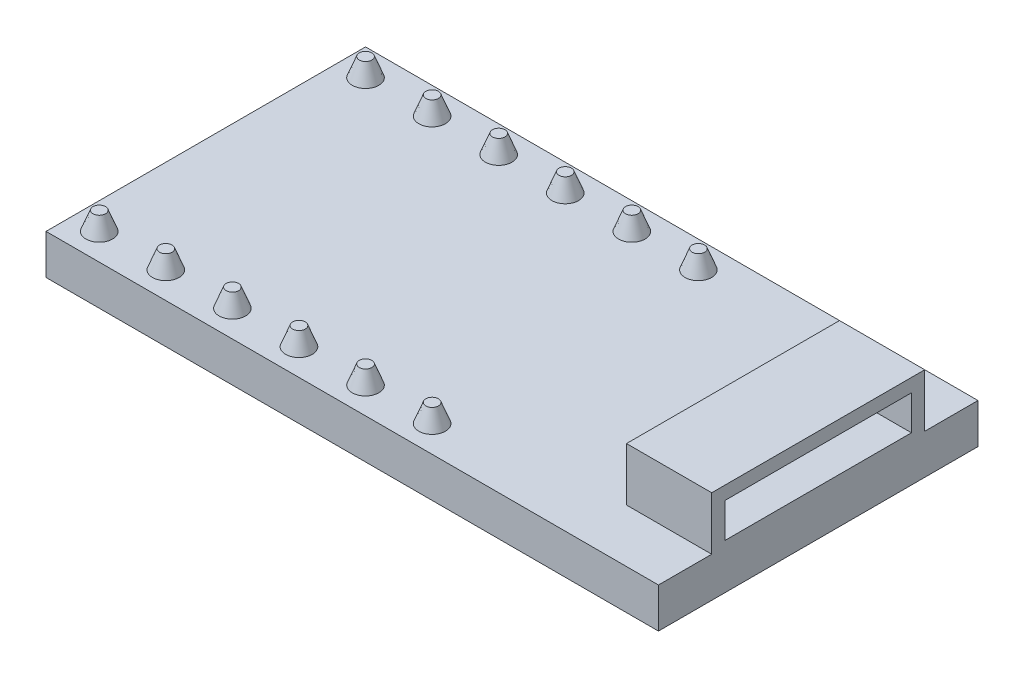
ISO-10303-21;
HEADER;
FILE_DESCRIPTION(('STEP AP214'),'2;1');
FILE_NAME('part.step','',(''),(''),'','','');
FILE_SCHEMA(('AUTOMOTIVE_DESIGN { 1 0 10303 214 1 1 1 1 }'));
ENDSEC;
DATA;
#1=APPLICATION_CONTEXT('core data for automotive mechanical design processes');
#2=APPLICATION_PROTOCOL_DEFINITION('international standard','automotive_design',2000,#1);
#3=PRODUCT_CONTEXT('',#1,'mechanical');
#4=PRODUCT('Part','Part','',(#3));
#5=PRODUCT_RELATED_PRODUCT_CATEGORY('part','',(#4));
#6=PRODUCT_DEFINITION_FORMATION('','',#4);
#7=PRODUCT_DEFINITION_CONTEXT('part definition',#1,'design');
#8=PRODUCT_DEFINITION('design','',#6,#7);
#9=PRODUCT_DEFINITION_SHAPE('','',#8);
#10=(LENGTH_UNIT() NAMED_UNIT(*) SI_UNIT(.MILLI.,.METRE.));
#11=(NAMED_UNIT(*) PLANE_ANGLE_UNIT() SI_UNIT($,.RADIAN.));
#12=(NAMED_UNIT(*) SI_UNIT($,.STERADIAN.) SOLID_ANGLE_UNIT());
#13=UNCERTAINTY_MEASURE_WITH_UNIT(LENGTH_MEASURE(1.E-05),#10,'distance_accuracy_value','');
#14=(GEOMETRIC_REPRESENTATION_CONTEXT(3) GLOBAL_UNCERTAINTY_ASSIGNED_CONTEXT((#13)) GLOBAL_UNIT_ASSIGNED_CONTEXT((#10,
#11,#12)) REPRESENTATION_CONTEXT('',''));
#15=CARTESIAN_POINT('',(0.,0.,0.));
#16=DIRECTION('',(0.,0.,1.));
#17=DIRECTION('',(1.,0.,0.));
#18=AXIS2_PLACEMENT_3D('',#15,#16,#17);
#19=CARTESIAN_POINT('',(2.00000000000001,2.19,-5.));
#20=DIRECTION('',(0.,1.,0.));
#21=DIRECTION('',(0.,0.,1.));
#22=AXIS2_PLACEMENT_3D('',#19,#20,#21);
#23=PLANE('',#22);
#24=CARTESIAN_POINT('',(2.00000000000001,2.19,-5.));
#25=DIRECTION('',(0.,1.,0.));
#26=DIRECTION('',(0.,0.,1.));
#27=AXIS2_PLACEMENT_3D('',#24,#25,#26);
#28=CIRCLE('',#27,0.235133815825563);
#29=CARTESIAN_POINT('',(2.00000000000001,2.19,-4.76486618417444));
#30=VERTEX_POINT('',#29);
#31=EDGE_CURVE('E12',#30,#30,#28,.T.);
#32=ORIENTED_EDGE('',*,*,#31,.T.);
#33=EDGE_LOOP('',(#32));
#34=FACE_BOUND('',#33,.T.);
#35=ADVANCED_FACE('F39',(#34),#23,.T.);
#36=CARTESIAN_POINT('',(2.00000000000001,1.5,-5.));
#37=DIRECTION('',(0.,-1.,0.));
#38=DIRECTION('',(0.,0.,1.));
#39=AXIS2_PLACEMENT_3D('',#36,#37,#38);
#40=CONICAL_SURFACE('',#39,0.500000000000001,0.36651914291881);
#41=ORIENTED_EDGE('',*,*,#31,.F.);
#42=EDGE_LOOP('',(#41));
#43=FACE_BOUND('',#42,.T.);
#44=CARTESIAN_POINT('',(2.00000000000001,1.5,-5.));
#45=DIRECTION('',(0.,-1.,0.));
#46=DIRECTION('',(0.,0.,-1.));
#47=AXIS2_PLACEMENT_3D('',#44,#45,#46);
#48=CIRCLE('',#47,0.500000000000001);
#49=CARTESIAN_POINT('',(2.00000000000001,1.5,-5.5));
#50=VERTEX_POINT('',#49);
#51=EDGE_CURVE('E46',#50,#50,#48,.F.);
#52=ORIENTED_EDGE('',*,*,#51,.T.);
#53=EDGE_LOOP('',(#52));
#54=FACE_BOUND('',#53,.T.);
#55=ADVANCED_FACE('F245',(#43,#54),#40,.T.);
#56=CARTESIAN_POINT('',(-0.499999999999995,2.19,-5.));
#57=DIRECTION('',(0.,1.,0.));
#58=DIRECTION('',(0.,0.,1.));
#59=AXIS2_PLACEMENT_3D('',#56,#57,#58);
#60=PLANE('',#59);
#61=CARTESIAN_POINT('',(-0.499999999999995,2.19,-5.));
#62=DIRECTION('',(0.,1.,0.));
#63=DIRECTION('',(0.,0.,1.));
#64=AXIS2_PLACEMENT_3D('',#61,#62,#63);
#65=CIRCLE('',#64,0.235133815825563);
#66=CARTESIAN_POINT('',(-0.499999999999995,2.19,-4.76486618417444));
#67=VERTEX_POINT('',#66);
#68=EDGE_CURVE('E240',#67,#67,#65,.T.);
#69=ORIENTED_EDGE('',*,*,#68,.T.);
#70=EDGE_LOOP('',(#69));
#71=FACE_BOUND('',#70,.T.);
#72=ADVANCED_FACE('F270',(#71),#60,.T.);
#73=CARTESIAN_POINT('',(-0.499999999999995,1.5,-5.));
#74=DIRECTION('',(0.,-1.,0.));
#75=DIRECTION('',(0.,0.,1.));
#76=AXIS2_PLACEMENT_3D('',#73,#74,#75);
#77=CONICAL_SURFACE('',#76,0.500000000000001,0.36651914291881);
#78=ORIENTED_EDGE('',*,*,#68,.F.);
#79=EDGE_LOOP('',(#78));
#80=FACE_BOUND('',#79,.T.);
#81=CARTESIAN_POINT('',(-0.499999999999995,1.5,-5.));
#82=DIRECTION('',(0.,-1.,0.));
#83=DIRECTION('',(0.,0.,-1.));
#84=AXIS2_PLACEMENT_3D('',#81,#82,#83);
#85=CIRCLE('',#84,0.500000000000001);
#86=CARTESIAN_POINT('',(-0.499999999999995,1.5,-5.5));
#87=VERTEX_POINT('',#86);
#88=EDGE_CURVE('E237',#87,#87,#85,.F.);
#89=ORIENTED_EDGE('',*,*,#88,.T.);
#90=EDGE_LOOP('',(#89));
#91=FACE_BOUND('',#90,.T.);
#92=ADVANCED_FACE('F276',(#80,#91),#77,.T.);
#93=CARTESIAN_POINT('',(-3.,2.19,-5.));
#94=DIRECTION('',(0.,1.,0.));
#95=DIRECTION('',(0.,0.,1.));
#96=AXIS2_PLACEMENT_3D('',#93,#94,#95);
#97=PLANE('',#96);
#98=CARTESIAN_POINT('',(-3.,2.19,-5.));
#99=DIRECTION('',(0.,1.,0.));
#100=DIRECTION('',(0.,0.,1.));
#101=AXIS2_PLACEMENT_3D('',#98,#99,#100);
#102=CIRCLE('',#101,0.235133815825563);
#103=CARTESIAN_POINT('',(-3.,2.19,-4.76486618417444));
#104=VERTEX_POINT('',#103);
#105=EDGE_CURVE('E234',#104,#104,#102,.T.);
#106=ORIENTED_EDGE('',*,*,#105,.T.);
#107=EDGE_LOOP('',(#106));
#108=FACE_BOUND('',#107,.T.);
#109=ADVANCED_FACE('F282',(#108),#97,.T.);
#110=CARTESIAN_POINT('',(-3.,1.5,-5.));
#111=DIRECTION('',(0.,-1.,0.));
#112=DIRECTION('',(0.,0.,1.));
#113=AXIS2_PLACEMENT_3D('',#110,#111,#112);
#114=CONICAL_SURFACE('',#113,0.500000000000001,0.36651914291881);
#115=ORIENTED_EDGE('',*,*,#105,.F.);
#116=EDGE_LOOP('',(#115));
#117=FACE_BOUND('',#116,.T.);
#118=CARTESIAN_POINT('',(-3.,1.5,-5.));
#119=DIRECTION('',(0.,-1.,0.));
#120=DIRECTION('',(0.,0.,-1.));
#121=AXIS2_PLACEMENT_3D('',#118,#119,#120);
#122=CIRCLE('',#121,0.500000000000001);
#123=CARTESIAN_POINT('',(-3.,1.5,-5.5));
#124=VERTEX_POINT('',#123);
#125=EDGE_CURVE('E231',#124,#124,#122,.F.);
#126=ORIENTED_EDGE('',*,*,#125,.T.);
#127=EDGE_LOOP('',(#126));
#128=FACE_BOUND('',#127,.T.);
#129=ADVANCED_FACE('F286',(#117,#128),#114,.T.);
#130=CARTESIAN_POINT('',(-5.49999999999999,2.19,-5.));
#131=DIRECTION('',(0.,1.,0.));
#132=DIRECTION('',(0.,0.,1.));
#133=AXIS2_PLACEMENT_3D('',#130,#131,#132);
#134=PLANE('',#133);
#135=CARTESIAN_POINT('',(-5.49999999999999,2.19,-5.));
#136=DIRECTION('',(0.,1.,0.));
#137=DIRECTION('',(0.,0.,1.));
#138=AXIS2_PLACEMENT_3D('',#135,#136,#137);
#139=CIRCLE('',#138,0.235133815825563);
#140=CARTESIAN_POINT('',(-5.49999999999999,2.19,-4.76486618417444));
#141=VERTEX_POINT('',#140);
#142=EDGE_CURVE('E228',#141,#141,#139,.T.);
#143=ORIENTED_EDGE('',*,*,#142,.T.);
#144=EDGE_LOOP('',(#143));
#145=FACE_BOUND('',#144,.T.);
#146=ADVANCED_FACE('F258',(#145),#134,.T.);
#147=CARTESIAN_POINT('',(-5.49999999999999,1.5,-5.));
#148=DIRECTION('',(0.,-1.,0.));
#149=DIRECTION('',(0.,0.,1.));
#150=AXIS2_PLACEMENT_3D('',#147,#148,#149);
#151=CONICAL_SURFACE('',#150,0.500000000000001,0.36651914291881);
#152=ORIENTED_EDGE('',*,*,#142,.F.);
#153=EDGE_LOOP('',(#152));
#154=FACE_BOUND('',#153,.T.);
#155=CARTESIAN_POINT('',(-5.49999999999999,1.5,-5.));
#156=DIRECTION('',(0.,-1.,0.));
#157=DIRECTION('',(0.,0.,-1.));
#158=AXIS2_PLACEMENT_3D('',#155,#156,#157);
#159=CIRCLE('',#158,0.500000000000001);
#160=CARTESIAN_POINT('',(-5.49999999999999,1.5,-5.5));
#161=VERTEX_POINT('',#160);
#162=EDGE_CURVE('E225',#161,#161,#159,.F.);
#163=ORIENTED_EDGE('',*,*,#162,.T.);
#164=EDGE_LOOP('',(#163));
#165=FACE_BOUND('',#164,.T.);
#166=ADVANCED_FACE('F249',(#154,#165),#151,.T.);
#167=CARTESIAN_POINT('',(0.,1.5,0.));
#168=DIRECTION('',(0.,-1.,0.));
#169=DIRECTION('',(0.,0.,-1.));
#170=AXIS2_PLACEMENT_3D('',#167,#168,#169);
#171=PLANE('',#170);
#172=CARTESIAN_POINT('',(2.00000000000001,1.5,5.));
#173=DIRECTION('',(0.,-1.,0.));
#174=DIRECTION('',(0.,0.,-1.));
#175=AXIS2_PLACEMENT_3D('',#172,#173,#174);
#176=CIRCLE('',#175,0.500000000000001);
#177=CARTESIAN_POINT('',(2.00000000000001,1.5,4.5));
#178=VERTEX_POINT('',#177);
#179=EDGE_CURVE('E431',#178,#178,#176,.T.);
#180=ORIENTED_EDGE('',*,*,#179,.T.);
#181=EDGE_LOOP('',(#180));
#182=FACE_BOUND('',#181,.T.);
#183=CARTESIAN_POINT('',(-0.499999999999995,1.5,5.));
#184=DIRECTION('',(0.,-1.,0.));
#185=DIRECTION('',(0.,0.,-1.));
#186=AXIS2_PLACEMENT_3D('',#183,#184,#185);
#187=CIRCLE('',#186,0.500000000000001);
#188=CARTESIAN_POINT('',(-0.499999999999995,1.5,4.5));
#189=VERTEX_POINT('',#188);
#190=EDGE_CURVE('E430',#189,#189,#187,.T.);
#191=ORIENTED_EDGE('',*,*,#190,.T.);
#192=EDGE_LOOP('',(#191));
#193=FACE_BOUND('',#192,.T.);
#194=CARTESIAN_POINT('',(-3.,1.5,5.));
#195=DIRECTION('',(0.,-1.,0.));
#196=DIRECTION('',(0.,0.,-1.));
#197=AXIS2_PLACEMENT_3D('',#194,#195,#196);
#198=CIRCLE('',#197,0.500000000000001);
#199=CARTESIAN_POINT('',(-3.,1.5,4.5));
#200=VERTEX_POINT('',#199);
#201=EDGE_CURVE('E440',#200,#200,#198,.T.);
#202=ORIENTED_EDGE('',*,*,#201,.T.);
#203=EDGE_LOOP('',(#202));
#204=FACE_BOUND('',#203,.T.);
#205=CARTESIAN_POINT('',(-5.5,1.5,5.));
#206=DIRECTION('',(0.,-1.,0.));
#207=DIRECTION('',(0.,0.,-1.));
#208=AXIS2_PLACEMENT_3D('',#205,#206,#207);
#209=CIRCLE('',#208,0.500000000000001);
#210=CARTESIAN_POINT('',(-5.5,1.5,4.5));
#211=VERTEX_POINT('',#210);
#212=EDGE_CURVE('E446',#211,#211,#209,.T.);
#213=ORIENTED_EDGE('',*,*,#212,.T.);
#214=EDGE_LOOP('',(#213));
#215=FACE_BOUND('',#214,.T.);
#216=CARTESIAN_POINT('',(-7.99999999999999,1.5,5.));
#217=DIRECTION('',(0.,-1.,0.));
#218=DIRECTION('',(0.,0.,-1.));
#219=AXIS2_PLACEMENT_3D('',#216,#217,#218);
#220=CIRCLE('',#219,0.500000000000001);
#221=CARTESIAN_POINT('',(-7.99999999999999,1.5,4.5));
#222=VERTEX_POINT('',#221);
#223=EDGE_CURVE('E452',#222,#222,#220,.T.);
#224=ORIENTED_EDGE('',*,*,#223,.T.);
#225=EDGE_LOOP('',(#224));
#226=FACE_BOUND('',#225,.T.);
#227=CARTESIAN_POINT('',(-10.5,1.5,5.));
#228=DIRECTION('',(0.,-1.,0.));
#229=DIRECTION('',(0.,0.,-1.));
#230=AXIS2_PLACEMENT_3D('',#227,#228,#229);
#231=CIRCLE('',#230,0.500000000000001);
#232=CARTESIAN_POINT('',(-10.5,1.5,4.5));
#233=VERTEX_POINT('',#232);
#234=EDGE_CURVE('E458',#233,#233,#231,.T.);
#235=ORIENTED_EDGE('',*,*,#234,.T.);
#236=EDGE_LOOP('',(#235));
#237=FACE_BOUND('',#236,.T.);
#238=CARTESIAN_POINT('',(-7.99999999999999,1.5,-5.));
#239=DIRECTION('',(0.,-1.,0.));
#240=DIRECTION('',(0.,0.,-1.));
#241=AXIS2_PLACEMENT_3D('',#238,#239,#240);
#242=CIRCLE('',#241,0.500000000000001);
#243=CARTESIAN_POINT('',(-7.99999999999999,1.5,-5.5));
#244=VERTEX_POINT('',#243);
#245=EDGE_CURVE('E222',#244,#244,#242,.F.);
#246=ORIENTED_EDGE('',*,*,#245,.F.);
#247=EDGE_LOOP('',(#246));
#248=FACE_BOUND('',#247,.T.);
#249=CARTESIAN_POINT('',(-10.5,1.5,-5.));
#250=DIRECTION('',(0.,-1.,0.));
#251=DIRECTION('',(0.,0.,-1.));
#252=AXIS2_PLACEMENT_3D('',#249,#250,#251);
#253=CIRCLE('',#252,0.500000000000001);
#254=CARTESIAN_POINT('',(-10.5,1.5,-5.5));
#255=VERTEX_POINT('',#254);
#256=EDGE_CURVE('E219',#255,#255,#253,.F.);
#257=ORIENTED_EDGE('',*,*,#256,.F.);
#258=EDGE_LOOP('',(#257));
#259=FACE_BOUND('',#258,.T.);
#260=DIRECTION('',(1.,0.,0.));
#261=VECTOR('',#260,1.);
#262=CARTESIAN_POINT('',(11.5,1.5,4.));
#263=LINE('',#262,#261);
#264=CARTESIAN_POINT('',(8.3,1.5,4.));
#265=VERTEX_POINT('',#264);
#266=CARTESIAN_POINT('',(11.5,1.5,4.));
#267=VERTEX_POINT('',#266);
#268=EDGE_CURVE('E61',#265,#267,#263,.T.);
#269=ORIENTED_EDGE('',*,*,#268,.F.);
#270=DIRECTION('',(0.,0.,1.));
#271=VECTOR('',#270,1.);
#272=CARTESIAN_POINT('',(8.3,1.5,4.));
#273=LINE('',#272,#271);
#274=CARTESIAN_POINT('',(8.3,1.5,-4.));
#275=VERTEX_POINT('',#274);
#276=EDGE_CURVE('E175',#275,#265,#273,.T.);
#277=ORIENTED_EDGE('',*,*,#276,.F.);
#278=DIRECTION('',(-1.,0.,0.));
#279=VECTOR('',#278,1.);
#280=CARTESIAN_POINT('',(11.5,1.5,-4.));
#281=LINE('',#280,#279);
#282=CARTESIAN_POINT('',(11.5,1.5,-4.));
#283=VERTEX_POINT('',#282);
#284=EDGE_CURVE('E161',#283,#275,#281,.T.);
#285=ORIENTED_EDGE('',*,*,#284,.F.);
#286=DIRECTION('',(0.,0.,-1.));
#287=VECTOR('',#286,1.);
#288=CARTESIAN_POINT('',(11.5,1.5,6.));
#289=LINE('',#288,#287);
#290=CARTESIAN_POINT('',(11.5,1.5,-6.));
#291=VERTEX_POINT('',#290);
#292=EDGE_CURVE('E193',#283,#291,#289,.T.);
#293=ORIENTED_EDGE('',*,*,#292,.T.);
#294=DIRECTION('',(-1.,0.,0.));
#295=VECTOR('',#294,1.);
#296=CARTESIAN_POINT('',(-11.5,1.5,-6.));
#297=LINE('',#296,#295);
#298=CARTESIAN_POINT('',(-11.5,1.5,-6.));
#299=VERTEX_POINT('',#298);
#300=EDGE_CURVE('E192',#291,#299,#297,.T.);
#301=ORIENTED_EDGE('',*,*,#300,.T.);
#302=DIRECTION('',(0.,0.,1.));
#303=VECTOR('',#302,1.);
#304=CARTESIAN_POINT('',(-11.5,1.5,6.));
#305=LINE('',#304,#303);
#306=CARTESIAN_POINT('',(-11.5,1.5,6.));
#307=VERTEX_POINT('',#306);
#308=EDGE_CURVE('E195',#299,#307,#305,.T.);
#309=ORIENTED_EDGE('',*,*,#308,.T.);
#310=DIRECTION('',(1.,0.,0.));
#311=VECTOR('',#310,1.);
#312=CARTESIAN_POINT('',(-11.5,1.5,6.));
#313=LINE('',#312,#311);
#314=CARTESIAN_POINT('',(11.5,1.5,6.));
#315=VERTEX_POINT('',#314);
#316=EDGE_CURVE('E197',#307,#315,#313,.T.);
#317=ORIENTED_EDGE('',*,*,#316,.T.);
#318=EDGE_CURVE('E190',#315,#267,#289,.T.);
#319=ORIENTED_EDGE('',*,*,#318,.T.);
#320=EDGE_LOOP('',(#269,#277,#285,#293,#301,#309,#317,#319));
#321=FACE_BOUND('',#320,.T.);
#322=ORIENTED_EDGE('',*,*,#162,.F.);
#323=EDGE_LOOP('',(#322));
#324=FACE_BOUND('',#323,.T.);
#325=ORIENTED_EDGE('',*,*,#125,.F.);
#326=EDGE_LOOP('',(#325));
#327=FACE_BOUND('',#326,.T.);
#328=ORIENTED_EDGE('',*,*,#88,.F.);
#329=EDGE_LOOP('',(#328));
#330=FACE_BOUND('',#329,.T.);
#331=ORIENTED_EDGE('',*,*,#51,.F.);
#332=EDGE_LOOP('',(#331));
#333=FACE_BOUND('',#332,.T.);
#334=ADVANCED_FACE('F247',(#182,#193,#204,#215,#226,#237,#248,#259,#321,#324,#327,#330,#333),
#171,.F.);
#335=CARTESIAN_POINT('',(11.5,1.5,6.));
#336=DIRECTION('',(-1.,0.,0.));
#337=DIRECTION('',(0.,0.,1.));
#338=AXIS2_PLACEMENT_3D('',#335,#336,#337);
#339=PLANE('',#338);
#340=DIRECTION('',(0.,0.,-1.));
#341=VECTOR('',#340,1.);
#342=CARTESIAN_POINT('',(11.5,1.7,3.5));
#343=LINE('',#342,#341);
#344=CARTESIAN_POINT('',(11.5,1.7,3.5));
#345=VERTEX_POINT('',#344);
#346=CARTESIAN_POINT('',(11.5,1.7,-3.5));
#347=VERTEX_POINT('',#346);
#348=EDGE_CURVE('E143',#345,#347,#343,.T.);
#349=ORIENTED_EDGE('',*,*,#348,.F.);
#350=DIRECTION('',(0.,-1.,0.));
#351=VECTOR('',#350,1.);
#352=CARTESIAN_POINT('',(11.5,3.,3.5));
#353=LINE('',#352,#351);
#354=CARTESIAN_POINT('',(11.5,3.,3.5));
#355=VERTEX_POINT('',#354);
#356=EDGE_CURVE('E53',#355,#345,#353,.T.);
#357=ORIENTED_EDGE('',*,*,#356,.F.);
#358=DIRECTION('',(0.,0.,1.));
#359=VECTOR('',#358,1.);
#360=CARTESIAN_POINT('',(11.5,3.,3.5));
#361=LINE('',#360,#359);
#362=CARTESIAN_POINT('',(11.5,3.,-3.5));
#363=VERTEX_POINT('',#362);
#364=EDGE_CURVE('E150',#363,#355,#361,.T.);
#365=ORIENTED_EDGE('',*,*,#364,.F.);
#366=DIRECTION('',(0.,1.,0.));
#367=VECTOR('',#366,1.);
#368=CARTESIAN_POINT('',(11.5,3.,-3.5));
#369=LINE('',#368,#367);
#370=EDGE_CURVE('E133',#347,#363,#369,.T.);
#371=ORIENTED_EDGE('',*,*,#370,.F.);
#372=EDGE_LOOP('',(#349,#357,#365,#371));
#373=FACE_BOUND('',#372,.T.);
#374=DIRECTION('',(0.,0.,-1.));
#375=VECTOR('',#374,1.);
#376=CARTESIAN_POINT('',(11.5,0.,6.));
#377=LINE('',#376,#375);
#378=CARTESIAN_POINT('',(11.5,0.,6.));
#379=VERTEX_POINT('',#378);
#380=CARTESIAN_POINT('',(11.5,0.,-6.));
#381=VERTEX_POINT('',#380);
#382=EDGE_CURVE('E189',#379,#381,#377,.T.);
#383=ORIENTED_EDGE('',*,*,#382,.T.);
#384=DIRECTION('',(0.,-1.,0.));
#385=VECTOR('',#384,1.);
#386=CARTESIAN_POINT('',(11.5,1.5,-6.));
#387=LINE('',#386,#385);
#388=EDGE_CURVE('E216',#291,#381,#387,.T.);
#389=ORIENTED_EDGE('',*,*,#388,.F.);
#390=ORIENTED_EDGE('',*,*,#292,.F.);
#391=DIRECTION('',(0.,-1.,0.));
#392=VECTOR('',#391,1.);
#393=CARTESIAN_POINT('',(11.5,3.5,-4.));
#394=LINE('',#393,#392);
#395=CARTESIAN_POINT('',(11.5,3.5,-4.));
#396=VERTEX_POINT('',#395);
#397=EDGE_CURVE('E186',#396,#283,#394,.T.);
#398=ORIENTED_EDGE('',*,*,#397,.F.);
#399=DIRECTION('',(0.,0.,-1.));
#400=VECTOR('',#399,1.);
#401=CARTESIAN_POINT('',(11.5,3.5,4.));
#402=LINE('',#401,#400);
#403=CARTESIAN_POINT('',(11.5,3.5,4.));
#404=VERTEX_POINT('',#403);
#405=EDGE_CURVE('E163',#404,#396,#402,.T.);
#406=ORIENTED_EDGE('',*,*,#405,.F.);
#407=DIRECTION('',(0.,-1.,0.));
#408=VECTOR('',#407,1.);
#409=CARTESIAN_POINT('',(11.5,3.5,4.));
#410=LINE('',#409,#408);
#411=EDGE_CURVE('E172',#404,#267,#410,.T.);
#412=ORIENTED_EDGE('',*,*,#411,.T.);
#413=ORIENTED_EDGE('',*,*,#318,.F.);
#414=DIRECTION('',(0.,-1.,0.));
#415=VECTOR('',#414,1.);
#416=CARTESIAN_POINT('',(11.5,1.5,6.));
#417=LINE('',#416,#415);
#418=EDGE_CURVE('E199',#315,#379,#417,.T.);
#419=ORIENTED_EDGE('',*,*,#418,.T.);
#420=EDGE_LOOP('',(#383,#389,#390,#398,#406,#412,#413,#419));
#421=FACE_BOUND('',#420,.T.);
#422=ADVANCED_FACE('F147',(#373,#421),#339,.F.);
#423=CARTESIAN_POINT('',(-11.5,1.5,-6.));
#424=DIRECTION('',(0.,0.,1.));
#425=DIRECTION('',(1.,0.,0.));
#426=AXIS2_PLACEMENT_3D('',#423,#424,#425);
#427=PLANE('',#426);
#428=DIRECTION('',(-1.,0.,0.));
#429=VECTOR('',#428,1.);
#430=CARTESIAN_POINT('',(-11.5,0.,-6.));
#431=LINE('',#430,#429);
#432=CARTESIAN_POINT('',(-11.5,0.,-6.));
#433=VERTEX_POINT('',#432);
#434=EDGE_CURVE('E202',#381,#433,#431,.T.);
#435=ORIENTED_EDGE('',*,*,#434,.T.);
#436=DIRECTION('',(0.,-1.,0.));
#437=VECTOR('',#436,1.);
#438=CARTESIAN_POINT('',(-11.5,1.5,-6.));
#439=LINE('',#438,#437);
#440=EDGE_CURVE('E213',#299,#433,#439,.T.);
#441=ORIENTED_EDGE('',*,*,#440,.F.);
#442=ORIENTED_EDGE('',*,*,#300,.F.);
#443=ORIENTED_EDGE('',*,*,#388,.T.);
#444=EDGE_LOOP('',(#435,#441,#442,#443));
#445=FACE_BOUND('',#444,.T.);
#446=ADVANCED_FACE('F256',(#445),#427,.F.);
#447=CARTESIAN_POINT('',(-11.5,1.5,6.));
#448=DIRECTION('',(1.,0.,0.));
#449=DIRECTION('',(0.,0.,-1.));
#450=AXIS2_PLACEMENT_3D('',#447,#448,#449);
#451=PLANE('',#450);
#452=DIRECTION('',(0.,0.,1.));
#453=VECTOR('',#452,1.);
#454=CARTESIAN_POINT('',(-11.5,0.,6.));
#455=LINE('',#454,#453);
#456=CARTESIAN_POINT('',(-11.5,0.,6.));
#457=VERTEX_POINT('',#456);
#458=EDGE_CURVE('E204',#433,#457,#455,.T.);
#459=ORIENTED_EDGE('',*,*,#458,.T.);
#460=DIRECTION('',(0.,-1.,0.));
#461=VECTOR('',#460,1.);
#462=CARTESIAN_POINT('',(-11.5,1.5,6.));
#463=LINE('',#462,#461);
#464=EDGE_CURVE('E210',#307,#457,#463,.T.);
#465=ORIENTED_EDGE('',*,*,#464,.F.);
#466=ORIENTED_EDGE('',*,*,#308,.F.);
#467=ORIENTED_EDGE('',*,*,#440,.T.);
#468=EDGE_LOOP('',(#459,#465,#466,#467));
#469=FACE_BOUND('',#468,.T.);
#470=ADVANCED_FACE('F296',(#469),#451,.F.);
#471=CARTESIAN_POINT('',(-11.5,1.5,6.));
#472=DIRECTION('',(0.,0.,-1.));
#473=DIRECTION('',(-1.,0.,0.));
#474=AXIS2_PLACEMENT_3D('',#471,#472,#473);
#475=PLANE('',#474);
#476=DIRECTION('',(1.,0.,0.));
#477=VECTOR('',#476,1.);
#478=CARTESIAN_POINT('',(-11.5,0.,6.));
#479=LINE('',#478,#477);
#480=EDGE_CURVE('E206',#457,#379,#479,.T.);
#481=ORIENTED_EDGE('',*,*,#480,.T.);
#482=ORIENTED_EDGE('',*,*,#418,.F.);
#483=ORIENTED_EDGE('',*,*,#316,.F.);
#484=ORIENTED_EDGE('',*,*,#464,.T.);
#485=EDGE_LOOP('',(#481,#482,#483,#484));
#486=FACE_BOUND('',#485,.T.);
#487=ADVANCED_FACE('F300',(#486),#475,.F.);
#488=CARTESIAN_POINT('',(0.,0.,0.));
#489=DIRECTION('',(0.,-1.,0.));
#490=DIRECTION('',(0.,0.,-1.));
#491=AXIS2_PLACEMENT_3D('',#488,#489,#490);
#492=PLANE('',#491);
#493=ORIENTED_EDGE('',*,*,#382,.F.);
#494=ORIENTED_EDGE('',*,*,#480,.F.);
#495=ORIENTED_EDGE('',*,*,#458,.F.);
#496=ORIENTED_EDGE('',*,*,#434,.F.);
#497=EDGE_LOOP('',(#493,#494,#495,#496));
#498=FACE_BOUND('',#497,.T.);
#499=ADVANCED_FACE('F303',(#498),#492,.T.);
#500=CARTESIAN_POINT('',(11.5,3.5,-4.));
#501=DIRECTION('',(0.,0.,1.));
#502=DIRECTION('',(1.,0.,0.));
#503=AXIS2_PLACEMENT_3D('',#500,#501,#502);
#504=PLANE('',#503);
#505=ORIENTED_EDGE('',*,*,#284,.T.);
#506=DIRECTION('',(0.,-1.,0.));
#507=VECTOR('',#506,1.);
#508=CARTESIAN_POINT('',(8.3,3.5,-4.));
#509=LINE('',#508,#507);
#510=CARTESIAN_POINT('',(8.3,3.5,-4.));
#511=VERTEX_POINT('',#510);
#512=EDGE_CURVE('E183',#511,#275,#509,.T.);
#513=ORIENTED_EDGE('',*,*,#512,.F.);
#514=DIRECTION('',(-1.,0.,0.));
#515=VECTOR('',#514,1.);
#516=CARTESIAN_POINT('',(11.5,3.5,-4.));
#517=LINE('',#516,#515);
#518=EDGE_CURVE('E166',#396,#511,#517,.T.);
#519=ORIENTED_EDGE('',*,*,#518,.F.);
#520=ORIENTED_EDGE('',*,*,#397,.T.);
#521=EDGE_LOOP('',(#505,#513,#519,#520));
#522=FACE_BOUND('',#521,.T.);
#523=ADVANCED_FACE('F306',(#522),#504,.F.);
#524=CARTESIAN_POINT('',(8.3,3.5,4.));
#525=DIRECTION('',(1.,0.,0.));
#526=DIRECTION('',(0.,0.,-1.));
#527=AXIS2_PLACEMENT_3D('',#524,#525,#526);
#528=PLANE('',#527);
#529=ORIENTED_EDGE('',*,*,#276,.T.);
#530=DIRECTION('',(0.,-1.,0.));
#531=VECTOR('',#530,1.);
#532=CARTESIAN_POINT('',(8.3,3.5,4.));
#533=LINE('',#532,#531);
#534=CARTESIAN_POINT('',(8.3,3.5,4.));
#535=VERTEX_POINT('',#534);
#536=EDGE_CURVE('E180',#535,#265,#533,.T.);
#537=ORIENTED_EDGE('',*,*,#536,.F.);
#538=DIRECTION('',(0.,0.,1.));
#539=VECTOR('',#538,1.);
#540=CARTESIAN_POINT('',(8.3,3.5,4.));
#541=LINE('',#540,#539);
#542=EDGE_CURVE('E168',#511,#535,#541,.T.);
#543=ORIENTED_EDGE('',*,*,#542,.F.);
#544=ORIENTED_EDGE('',*,*,#512,.T.);
#545=EDGE_LOOP('',(#529,#537,#543,#544));
#546=FACE_BOUND('',#545,.T.);
#547=ADVANCED_FACE('F311',(#546),#528,.F.);
#548=CARTESIAN_POINT('',(11.5,3.5,4.));
#549=DIRECTION('',(0.,0.,-1.));
#550=DIRECTION('',(-1.,0.,0.));
#551=AXIS2_PLACEMENT_3D('',#548,#549,#550);
#552=PLANE('',#551);
#553=ORIENTED_EDGE('',*,*,#268,.T.);
#554=ORIENTED_EDGE('',*,*,#411,.F.);
#555=DIRECTION('',(1.,0.,0.));
#556=VECTOR('',#555,1.);
#557=CARTESIAN_POINT('',(11.5,3.5,4.));
#558=LINE('',#557,#556);
#559=EDGE_CURVE('E170',#535,#404,#558,.T.);
#560=ORIENTED_EDGE('',*,*,#559,.F.);
#561=ORIENTED_EDGE('',*,*,#536,.T.);
#562=EDGE_LOOP('',(#553,#554,#560,#561));
#563=FACE_BOUND('',#562,.T.);
#564=ADVANCED_FACE('F335',(#563),#552,.F.);
#565=CARTESIAN_POINT('',(0.,3.5,0.));
#566=DIRECTION('',(0.,1.,0.));
#567=DIRECTION('',(0.,0.,1.));
#568=AXIS2_PLACEMENT_3D('',#565,#566,#567);
#569=PLANE('',#568);
#570=ORIENTED_EDGE('',*,*,#405,.T.);
#571=ORIENTED_EDGE('',*,*,#518,.T.);
#572=ORIENTED_EDGE('',*,*,#542,.T.);
#573=ORIENTED_EDGE('',*,*,#559,.T.);
#574=EDGE_LOOP('',(#570,#571,#572,#573));
#575=FACE_BOUND('',#574,.T.);
#576=ADVANCED_FACE('F331',(#575),#569,.T.);
#577=CARTESIAN_POINT('',(1.18030899546898,3.,3.5));
#578=DIRECTION('',(0.,0.,1.));
#579=DIRECTION('',(1.,0.,0.));
#580=AXIS2_PLACEMENT_3D('',#577,#578,#579);
#581=PLANE('',#580);
#582=DIRECTION('',(0.,1.,0.));
#583=VECTOR('',#582,1.);
#584=CARTESIAN_POINT('',(8.8,3.,3.5));
#585=LINE('',#584,#583);
#586=CARTESIAN_POINT('',(8.8,1.7,3.5));
#587=VERTEX_POINT('',#586);
#588=CARTESIAN_POINT('',(8.8,3.,3.5));
#589=VERTEX_POINT('',#588);
#590=EDGE_CURVE('E162',#587,#589,#585,.T.);
#591=ORIENTED_EDGE('',*,*,#590,.T.);
#592=DIRECTION('',(1.,0.,0.));
#593=VECTOR('',#592,1.);
#594=CARTESIAN_POINT('',(1.18030899546898,3.,3.5));
#595=LINE('',#594,#593);
#596=EDGE_CURVE('E155',#589,#355,#595,.T.);
#597=ORIENTED_EDGE('',*,*,#596,.T.);
#598=ORIENTED_EDGE('',*,*,#356,.T.);
#599=DIRECTION('',(1.,0.,0.));
#600=VECTOR('',#599,1.);
#601=CARTESIAN_POINT('',(1.18030899546898,1.7,3.5));
#602=LINE('',#601,#600);
#603=EDGE_CURVE('E140',#587,#345,#602,.T.);
#604=ORIENTED_EDGE('',*,*,#603,.F.);
#605=EDGE_LOOP('',(#591,#597,#598,#604));
#606=FACE_BOUND('',#605,.T.);
#607=ADVANCED_FACE('F347',(#606),#581,.F.);
#608=CARTESIAN_POINT('',(1.18030899546898,3.,3.5));
#609=DIRECTION('',(0.,1.,0.));
#610=DIRECTION('',(0.,0.,1.));
#611=AXIS2_PLACEMENT_3D('',#608,#609,#610);
#612=PLANE('',#611);
#613=DIRECTION('',(0.,0.,-1.));
#614=VECTOR('',#613,1.);
#615=CARTESIAN_POINT('',(8.8,3.,3.5));
#616=LINE('',#615,#614);
#617=CARTESIAN_POINT('',(8.8,3.,-3.5));
#618=VERTEX_POINT('',#617);
#619=EDGE_CURVE('E471',#589,#618,#616,.T.);
#620=ORIENTED_EDGE('',*,*,#619,.T.);
#621=DIRECTION('',(1.,0.,0.));
#622=VECTOR('',#621,1.);
#623=CARTESIAN_POINT('',(1.18030899546898,3.,-3.5));
#624=LINE('',#623,#622);
#625=EDGE_CURVE('E139',#618,#363,#624,.T.);
#626=ORIENTED_EDGE('',*,*,#625,.T.);
#627=ORIENTED_EDGE('',*,*,#364,.T.);
#628=ORIENTED_EDGE('',*,*,#596,.F.);
#629=EDGE_LOOP('',(#620,#626,#627,#628));
#630=FACE_BOUND('',#629,.T.);
#631=ADVANCED_FACE('F350',(#630),#612,.F.);
#632=CARTESIAN_POINT('',(1.18030899546898,3.,-3.5));
#633=DIRECTION('',(0.,0.,-1.));
#634=DIRECTION('',(-1.,0.,0.));
#635=AXIS2_PLACEMENT_3D('',#632,#633,#634);
#636=PLANE('',#635);
#637=DIRECTION('',(0.,-1.,0.));
#638=VECTOR('',#637,1.);
#639=CARTESIAN_POINT('',(8.8,3.,-3.5));
#640=LINE('',#639,#638);
#641=CARTESIAN_POINT('',(8.8,1.7,-3.5));
#642=VERTEX_POINT('',#641);
#643=EDGE_CURVE('E136',#618,#642,#640,.T.);
#644=ORIENTED_EDGE('',*,*,#643,.T.);
#645=DIRECTION('',(1.,0.,0.));
#646=VECTOR('',#645,1.);
#647=CARTESIAN_POINT('',(1.18030899546898,1.7,-3.5));
#648=LINE('',#647,#646);
#649=EDGE_CURVE('E128',#642,#347,#648,.T.);
#650=ORIENTED_EDGE('',*,*,#649,.T.);
#651=ORIENTED_EDGE('',*,*,#370,.T.);
#652=ORIENTED_EDGE('',*,*,#625,.F.);
#653=EDGE_LOOP('',(#644,#650,#651,#652));
#654=FACE_BOUND('',#653,.T.);
#655=ADVANCED_FACE('F130',(#654),#636,.F.);
#656=CARTESIAN_POINT('',(1.18030899546898,1.7,3.5));
#657=DIRECTION('',(0.,-1.,0.));
#658=DIRECTION('',(0.,0.,-1.));
#659=AXIS2_PLACEMENT_3D('',#656,#657,#658);
#660=PLANE('',#659);
#661=DIRECTION('',(0.,0.,1.));
#662=VECTOR('',#661,1.);
#663=CARTESIAN_POINT('',(8.8,1.7,3.5));
#664=LINE('',#663,#662);
#665=EDGE_CURVE('E159',#642,#587,#664,.T.);
#666=ORIENTED_EDGE('',*,*,#665,.T.);
#667=ORIENTED_EDGE('',*,*,#603,.T.);
#668=ORIENTED_EDGE('',*,*,#348,.T.);
#669=ORIENTED_EDGE('',*,*,#649,.F.);
#670=EDGE_LOOP('',(#666,#667,#668,#669));
#671=FACE_BOUND('',#670,.T.);
#672=ADVANCED_FACE('F144',(#671),#660,.F.);
#673=CARTESIAN_POINT('',(8.8,3.5,4.));
#674=DIRECTION('',(1.,0.,0.));
#675=DIRECTION('',(0.,0.,-1.));
#676=AXIS2_PLACEMENT_3D('',#673,#674,#675);
#677=PLANE('',#676);
#678=ORIENTED_EDGE('',*,*,#590,.F.);
#679=ORIENTED_EDGE('',*,*,#665,.F.);
#680=ORIENTED_EDGE('',*,*,#643,.F.);
#681=ORIENTED_EDGE('',*,*,#619,.F.);
#682=EDGE_LOOP('',(#678,#679,#680,#681));
#683=FACE_BOUND('',#682,.T.);
#684=ADVANCED_FACE('F353',(#683),#677,.T.);
#685=CARTESIAN_POINT('',(-10.5,1.5,-5.));
#686=DIRECTION('',(0.,-1.,0.));
#687=DIRECTION('',(0.,0.,1.));
#688=AXIS2_PLACEMENT_3D('',#685,#686,#687);
#689=CONICAL_SURFACE('',#688,0.500000000000001,0.36651914291881);
#690=CARTESIAN_POINT('',(-10.5,2.19,-5.));
#691=DIRECTION('',(0.,1.,0.));
#692=DIRECTION('',(0.,0.,1.));
#693=AXIS2_PLACEMENT_3D('',#690,#691,#692);
#694=CIRCLE('',#693,0.235133815825563);
#695=CARTESIAN_POINT('',(-10.5,2.19,-4.76486618417444));
#696=VERTEX_POINT('',#695);
#697=EDGE_CURVE('E467',#696,#696,#694,.T.);
#698=ORIENTED_EDGE('',*,*,#697,.F.);
#699=EDGE_LOOP('',(#698));
#700=FACE_BOUND('',#699,.T.);
#701=ORIENTED_EDGE('',*,*,#256,.T.);
#702=EDGE_LOOP('',(#701));
#703=FACE_BOUND('',#702,.T.);
#704=ADVANCED_FACE('F361',(#700,#703),#689,.T.);
#705=CARTESIAN_POINT('',(-10.5,2.19,-5.));
#706=DIRECTION('',(0.,1.,0.));
#707=DIRECTION('',(0.,0.,1.));
#708=AXIS2_PLACEMENT_3D('',#705,#706,#707);
#709=PLANE('',#708);
#710=ORIENTED_EDGE('',*,*,#697,.T.);
#711=EDGE_LOOP('',(#710));
#712=FACE_BOUND('',#711,.T.);
#713=ADVANCED_FACE('F365',(#712),#709,.T.);
#714=CARTESIAN_POINT('',(-7.99999999999999,1.5,-5.));
#715=DIRECTION('',(0.,-1.,0.));
#716=DIRECTION('',(0.,0.,1.));
#717=AXIS2_PLACEMENT_3D('',#714,#715,#716);
#718=CONICAL_SURFACE('',#717,0.500000000000001,0.36651914291881);
#719=CARTESIAN_POINT('',(-7.99999999999999,2.19,-5.));
#720=DIRECTION('',(0.,1.,0.));
#721=DIRECTION('',(0.,0.,1.));
#722=AXIS2_PLACEMENT_3D('',#719,#720,#721);
#723=CIRCLE('',#722,0.235133815825563);
#724=CARTESIAN_POINT('',(-7.99999999999999,2.19,-4.76486618417444));
#725=VERTEX_POINT('',#724);
#726=EDGE_CURVE('E464',#725,#725,#723,.T.);
#727=ORIENTED_EDGE('',*,*,#726,.F.);
#728=EDGE_LOOP('',(#727));
#729=FACE_BOUND('',#728,.T.);
#730=ORIENTED_EDGE('',*,*,#245,.T.);
#731=EDGE_LOOP('',(#730));
#732=FACE_BOUND('',#731,.T.);
#733=ADVANCED_FACE('F369',(#729,#732),#718,.T.);
#734=CARTESIAN_POINT('',(-7.99999999999999,2.19,-5.));
#735=DIRECTION('',(0.,1.,0.));
#736=DIRECTION('',(0.,0.,1.));
#737=AXIS2_PLACEMENT_3D('',#734,#735,#736);
#738=PLANE('',#737);
#739=ORIENTED_EDGE('',*,*,#726,.T.);
#740=EDGE_LOOP('',(#739));
#741=FACE_BOUND('',#740,.T.);
#742=ADVANCED_FACE('F373',(#741),#738,.T.);
#743=CARTESIAN_POINT('',(-10.5,1.5,5.));
#744=DIRECTION('',(0.,-1.,0.));
#745=DIRECTION('',(0.,0.,-1.));
#746=AXIS2_PLACEMENT_3D('',#743,#744,#745);
#747=CONICAL_SURFACE('',#746,0.500000000000001,0.36651914291881);
#748=CARTESIAN_POINT('',(-10.5,2.19,5.));
#749=DIRECTION('',(0.,1.,0.));
#750=DIRECTION('',(0.,0.,1.));
#751=AXIS2_PLACEMENT_3D('',#748,#749,#750);
#752=CIRCLE('',#751,0.235133815825563);
#753=CARTESIAN_POINT('',(-10.5,2.19,5.23513381582556));
#754=VERTEX_POINT('',#753);
#755=EDGE_CURVE('E461',#754,#754,#752,.F.);
#756=ORIENTED_EDGE('',*,*,#755,.T.);
#757=EDGE_LOOP('',(#756));
#758=FACE_BOUND('',#757,.T.);
#759=ORIENTED_EDGE('',*,*,#234,.F.);
#760=EDGE_LOOP('',(#759));
#761=FACE_BOUND('',#760,.T.);
#762=ADVANCED_FACE('F377',(#758,#761),#747,.T.);
#763=CARTESIAN_POINT('',(-10.5,2.19,5.));
#764=DIRECTION('',(0.,1.,0.));
#765=DIRECTION('',(0.,0.,-1.));
#766=AXIS2_PLACEMENT_3D('',#763,#764,#765);
#767=PLANE('',#766);
#768=ORIENTED_EDGE('',*,*,#755,.F.);
#769=EDGE_LOOP('',(#768));
#770=FACE_BOUND('',#769,.T.);
#771=ADVANCED_FACE('F381',(#770),#767,.T.);
#772=CARTESIAN_POINT('',(-7.99999999999999,1.5,5.));
#773=DIRECTION('',(0.,-1.,0.));
#774=DIRECTION('',(0.,0.,-1.));
#775=AXIS2_PLACEMENT_3D('',#772,#773,#774);
#776=CONICAL_SURFACE('',#775,0.500000000000001,0.36651914291881);
#777=CARTESIAN_POINT('',(-7.99999999999999,2.19,5.));
#778=DIRECTION('',(0.,1.,0.));
#779=DIRECTION('',(0.,0.,1.));
#780=AXIS2_PLACEMENT_3D('',#777,#778,#779);
#781=CIRCLE('',#780,0.235133815825563);
#782=CARTESIAN_POINT('',(-7.99999999999999,2.19,5.23513381582556));
#783=VERTEX_POINT('',#782);
#784=EDGE_CURVE('E455',#783,#783,#781,.F.);
#785=ORIENTED_EDGE('',*,*,#784,.T.);
#786=EDGE_LOOP('',(#785));
#787=FACE_BOUND('',#786,.T.);
#788=ORIENTED_EDGE('',*,*,#223,.F.);
#789=EDGE_LOOP('',(#788));
#790=FACE_BOUND('',#789,.T.);
#791=ADVANCED_FACE('F385',(#787,#790),#776,.T.);
#792=CARTESIAN_POINT('',(-7.99999999999999,2.19,5.));
#793=DIRECTION('',(0.,1.,0.));
#794=DIRECTION('',(0.,0.,-1.));
#795=AXIS2_PLACEMENT_3D('',#792,#793,#794);
#796=PLANE('',#795);
#797=ORIENTED_EDGE('',*,*,#784,.F.);
#798=EDGE_LOOP('',(#797));
#799=FACE_BOUND('',#798,.T.);
#800=ADVANCED_FACE('F389',(#799),#796,.T.);
#801=CARTESIAN_POINT('',(-5.5,1.5,5.));
#802=DIRECTION('',(0.,-1.,0.));
#803=DIRECTION('',(0.,0.,-1.));
#804=AXIS2_PLACEMENT_3D('',#801,#802,#803);
#805=CONICAL_SURFACE('',#804,0.500000000000001,0.36651914291881);
#806=CARTESIAN_POINT('',(-5.5,2.19,5.));
#807=DIRECTION('',(0.,1.,0.));
#808=DIRECTION('',(0.,0.,1.));
#809=AXIS2_PLACEMENT_3D('',#806,#807,#808);
#810=CIRCLE('',#809,0.235133815825563);
#811=CARTESIAN_POINT('',(-5.5,2.19,5.23513381582556));
#812=VERTEX_POINT('',#811);
#813=EDGE_CURVE('E449',#812,#812,#810,.F.);
#814=ORIENTED_EDGE('',*,*,#813,.T.);
#815=EDGE_LOOP('',(#814));
#816=FACE_BOUND('',#815,.T.);
#817=ORIENTED_EDGE('',*,*,#212,.F.);
#818=EDGE_LOOP('',(#817));
#819=FACE_BOUND('',#818,.T.);
#820=ADVANCED_FACE('F393',(#816,#819),#805,.T.);
#821=CARTESIAN_POINT('',(-5.5,2.19,5.));
#822=DIRECTION('',(0.,1.,0.));
#823=DIRECTION('',(0.,0.,-1.));
#824=AXIS2_PLACEMENT_3D('',#821,#822,#823);
#825=PLANE('',#824);
#826=ORIENTED_EDGE('',*,*,#813,.F.);
#827=EDGE_LOOP('',(#826));
#828=FACE_BOUND('',#827,.T.);
#829=ADVANCED_FACE('F397',(#828),#825,.T.);
#830=CARTESIAN_POINT('',(-3.,1.5,5.));
#831=DIRECTION('',(0.,-1.,0.));
#832=DIRECTION('',(0.,0.,-1.));
#833=AXIS2_PLACEMENT_3D('',#830,#831,#832);
#834=CONICAL_SURFACE('',#833,0.500000000000001,0.36651914291881);
#835=CARTESIAN_POINT('',(-3.,2.19,5.));
#836=DIRECTION('',(0.,1.,0.));
#837=DIRECTION('',(0.,0.,1.));
#838=AXIS2_PLACEMENT_3D('',#835,#836,#837);
#839=CIRCLE('',#838,0.235133815825563);
#840=CARTESIAN_POINT('',(-3.,2.19,5.23513381582556));
#841=VERTEX_POINT('',#840);
#842=EDGE_CURVE('E443',#841,#841,#839,.F.);
#843=ORIENTED_EDGE('',*,*,#842,.T.);
#844=EDGE_LOOP('',(#843));
#845=FACE_BOUND('',#844,.T.);
#846=ORIENTED_EDGE('',*,*,#201,.F.);
#847=EDGE_LOOP('',(#846));
#848=FACE_BOUND('',#847,.T.);
#849=ADVANCED_FACE('F401',(#845,#848),#834,.T.);
#850=CARTESIAN_POINT('',(-3.,2.19,5.));
#851=DIRECTION('',(0.,1.,0.));
#852=DIRECTION('',(0.,0.,-1.));
#853=AXIS2_PLACEMENT_3D('',#850,#851,#852);
#854=PLANE('',#853);
#855=ORIENTED_EDGE('',*,*,#842,.F.);
#856=EDGE_LOOP('',(#855));
#857=FACE_BOUND('',#856,.T.);
#858=ADVANCED_FACE('F405',(#857),#854,.T.);
#859=CARTESIAN_POINT('',(-0.499999999999995,1.5,5.));
#860=DIRECTION('',(0.,-1.,0.));
#861=DIRECTION('',(0.,0.,-1.));
#862=AXIS2_PLACEMENT_3D('',#859,#860,#861);
#863=CONICAL_SURFACE('',#862,0.500000000000001,0.36651914291881);
#864=CARTESIAN_POINT('',(-0.499999999999995,2.19,5.));
#865=DIRECTION('',(0.,1.,0.));
#866=DIRECTION('',(0.,0.,1.));
#867=AXIS2_PLACEMENT_3D('',#864,#865,#866);
#868=CIRCLE('',#867,0.235133815825563);
#869=CARTESIAN_POINT('',(-0.499999999999995,2.19,5.23513381582556));
#870=VERTEX_POINT('',#869);
#871=EDGE_CURVE('E434',#870,#870,#868,.F.);
#872=ORIENTED_EDGE('',*,*,#871,.T.);
#873=EDGE_LOOP('',(#872));
#874=FACE_BOUND('',#873,.T.);
#875=ORIENTED_EDGE('',*,*,#190,.F.);
#876=EDGE_LOOP('',(#875));
#877=FACE_BOUND('',#876,.T.);
#878=ADVANCED_FACE('F409',(#874,#877),#863,.T.);
#879=CARTESIAN_POINT('',(-0.499999999999995,2.19,5.));
#880=DIRECTION('',(0.,1.,0.));
#881=DIRECTION('',(0.,0.,-1.));
#882=AXIS2_PLACEMENT_3D('',#879,#880,#881);
#883=PLANE('',#882);
#884=ORIENTED_EDGE('',*,*,#871,.F.);
#885=EDGE_LOOP('',(#884));
#886=FACE_BOUND('',#885,.T.);
#887=ADVANCED_FACE('F413',(#886),#883,.T.);
#888=CARTESIAN_POINT('',(2.00000000000001,1.5,5.));
#889=DIRECTION('',(0.,-1.,0.));
#890=DIRECTION('',(0.,0.,-1.));
#891=AXIS2_PLACEMENT_3D('',#888,#889,#890);
#892=CONICAL_SURFACE('',#891,0.500000000000001,0.36651914291881);
#893=CARTESIAN_POINT('',(2.00000000000001,2.19,5.));
#894=DIRECTION('',(0.,1.,0.));
#895=DIRECTION('',(0.,0.,1.));
#896=AXIS2_PLACEMENT_3D('',#893,#894,#895);
#897=CIRCLE('',#896,0.235133815825563);
#898=CARTESIAN_POINT('',(2.00000000000001,2.19,5.23513381582556));
#899=VERTEX_POINT('',#898);
#900=EDGE_CURVE('E429',#899,#899,#897,.F.);
#901=ORIENTED_EDGE('',*,*,#900,.T.);
#902=EDGE_LOOP('',(#901));
#903=FACE_BOUND('',#902,.T.);
#904=ORIENTED_EDGE('',*,*,#179,.F.);
#905=EDGE_LOOP('',(#904));
#906=FACE_BOUND('',#905,.T.);
#907=ADVANCED_FACE('F417',(#903,#906),#892,.T.);
#908=CARTESIAN_POINT('',(2.00000000000001,2.19,5.));
#909=DIRECTION('',(0.,1.,0.));
#910=DIRECTION('',(0.,0.,-1.));
#911=AXIS2_PLACEMENT_3D('',#908,#909,#910);
#912=PLANE('',#911);
#913=ORIENTED_EDGE('',*,*,#900,.F.);
#914=EDGE_LOOP('',(#913));
#915=FACE_BOUND('',#914,.T.);
#916=ADVANCED_FACE('F421',(#915),#912,.T.);
#917=CLOSED_SHELL('',(#35,#55,#72,#92,#109,#129,#146,#166,#334,#422,#446,#470,#487,#499,#523,
#547,#564,#576,#607,#631,#655,#672,#684,#704,#713,#733,#742,#762,#771,#791,#800,#820,#829,#849,
#858,#878,#887,#907,#916));
#918=MANIFOLD_SOLID_BREP('B2',#917);
#919=ADVANCED_BREP_SHAPE_REPRESENTATION('',(#18,#918),#14);
#920=SHAPE_DEFINITION_REPRESENTATION(#9,#919);
ENDSEC;
END-ISO-10303-21;
